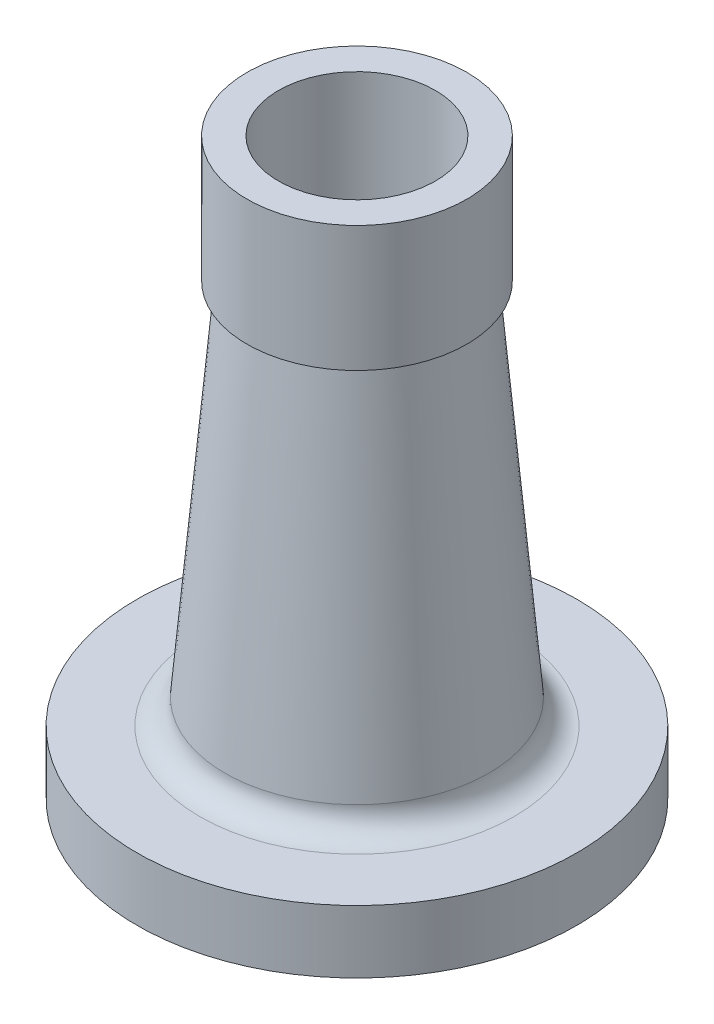
ISO-10303-21;
HEADER;
FILE_DESCRIPTION(('STEP AP214'),'2;1');
FILE_NAME('part.step','',(''),(''),'','','');
FILE_SCHEMA(('AUTOMOTIVE_DESIGN { 1 0 10303 214 1 1 1 1 }'));
ENDSEC;
DATA;
#1=APPLICATION_CONTEXT('core data for automotive mechanical design processes');
#2=APPLICATION_PROTOCOL_DEFINITION('international standard','automotive_design',2000,#1);
#3=PRODUCT_CONTEXT('',#1,'mechanical');
#4=PRODUCT('Part','Part','',(#3));
#5=PRODUCT_RELATED_PRODUCT_CATEGORY('part','',(#4));
#6=PRODUCT_DEFINITION_FORMATION('','',#4);
#7=PRODUCT_DEFINITION_CONTEXT('part definition',#1,'design');
#8=PRODUCT_DEFINITION('design','',#6,#7);
#9=PRODUCT_DEFINITION_SHAPE('','',#8);
#10=(LENGTH_UNIT() NAMED_UNIT(*) SI_UNIT(.MILLI.,.METRE.));
#11=(NAMED_UNIT(*) PLANE_ANGLE_UNIT() SI_UNIT($,.RADIAN.));
#12=(NAMED_UNIT(*) SI_UNIT($,.STERADIAN.) SOLID_ANGLE_UNIT());
#13=UNCERTAINTY_MEASURE_WITH_UNIT(LENGTH_MEASURE(1.E-05),#10,'distance_accuracy_value','');
#14=(GEOMETRIC_REPRESENTATION_CONTEXT(3) GLOBAL_UNCERTAINTY_ASSIGNED_CONTEXT((#13)) GLOBAL_UNIT_ASSIGNED_CONTEXT((#10,
#11,#12)) REPRESENTATION_CONTEXT('',''));
#15=CARTESIAN_POINT('',(0.,0.,0.));
#16=DIRECTION('',(0.,0.,1.));
#17=DIRECTION('',(1.,0.,0.));
#18=AXIS2_PLACEMENT_3D('',#15,#16,#17);
#19=CARTESIAN_POINT('',(0.,-90.2788606175711,0.));
#20=DIRECTION('',(0.,-1.,0.));
#21=DIRECTION('',(0.,0.,-1.));
#22=AXIS2_PLACEMENT_3D('',#19,#20,#21);
#23=CYLINDRICAL_SURFACE('',#22,25.);
#24=CARTESIAN_POINT('',(0.,17.3420060444589,0.));
#25=DIRECTION('',(0.,-1.,0.));
#26=DIRECTION('',(0.,0.,-1.));
#27=AXIS2_PLACEMENT_3D('',#24,#25,#26);
#28=CIRCLE('',#27,25.);
#29=CARTESIAN_POINT('',(0.,17.3420060444589,-25.));
#30=VERTEX_POINT('',#29);
#31=EDGE_CURVE('E41',#30,#30,#28,.T.);
#32=ORIENTED_EDGE('',*,*,#31,.T.);
#33=EDGE_LOOP('',(#32));
#34=FACE_BOUND('',#33,.T.);
#35=CARTESIAN_POINT('',(0.,92.5,0.));
#36=DIRECTION('',(0.,-1.,0.));
#37=DIRECTION('',(0.,0.,-1.));
#38=AXIS2_PLACEMENT_3D('',#35,#36,#37);
#39=CIRCLE('',#38,25.);
#40=CARTESIAN_POINT('',(0.,92.5,-25.));
#41=VERTEX_POINT('',#40);
#42=EDGE_CURVE('E77',#41,#41,#39,.T.);
#43=ORIENTED_EDGE('',*,*,#42,.F.);
#44=EDGE_LOOP('',(#43));
#45=FACE_BOUND('',#44,.T.);
#46=ADVANCED_FACE('F30',(#34,#45),#23,.F.);
#47=CARTESIAN_POINT('',(0.,17.3420060444589,0.));
#48=DIRECTION('',(0.,-1.,0.));
#49=DIRECTION('',(0.,0.,-1.));
#50=AXIS2_PLACEMENT_3D('',#47,#48,#49);
#51=CONICAL_SURFACE('',#50,25.,0.0874448423892873);
#52=CARTESIAN_POINT('',(0.,-28.998781924089,0.));
#53=DIRECTION('',(0.,-1.,0.));
#54=DIRECTION('',(0.,0.,-1.));
#55=AXIS2_PLACEMENT_3D('',#52,#53,#54);
#56=CIRCLE('',#55,29.0626232683506);
#57=CARTESIAN_POINT('',(0.,-28.998781924089,-29.0626232683506));
#58=VERTEX_POINT('',#57);
#59=EDGE_CURVE('E45',#58,#58,#56,.T.);
#60=ORIENTED_EDGE('',*,*,#59,.T.);
#61=EDGE_LOOP('',(#60));
#62=FACE_BOUND('',#61,.T.);
#63=ORIENTED_EDGE('',*,*,#31,.F.);
#64=EDGE_LOOP('',(#63));
#65=FACE_BOUND('',#64,.T.);
#66=ADVANCED_FACE('F85',(#62,#65),#51,.F.);
#67=CARTESIAN_POINT('',(0.,-28.998781924089,0.));
#68=DIRECTION('',(0.,-1.,0.));
#69=DIRECTION('',(0.,0.,-1.));
#70=AXIS2_PLACEMENT_3D('',#67,#68,#69);
#71=CONICAL_SURFACE('',#70,29.0626232683506,0.101526332920951);
#72=CARTESIAN_POINT('',(0.,-87.2788606175711,0.));
#73=DIRECTION('',(0.,-1.,0.));
#74=DIRECTION('',(0.,0.,-1.));
#75=AXIS2_PLACEMENT_3D('',#72,#73,#74);
#76=CIRCLE('',#75,35.);
#77=CARTESIAN_POINT('',(0.,-87.2788606175711,-35.));
#78=VERTEX_POINT('',#77);
#79=EDGE_CURVE('E50',#78,#78,#76,.T.);
#80=ORIENTED_EDGE('',*,*,#79,.T.);
#81=EDGE_LOOP('',(#80));
#82=FACE_BOUND('',#81,.T.);
#83=ORIENTED_EDGE('',*,*,#59,.F.);
#84=EDGE_LOOP('',(#83));
#85=FACE_BOUND('',#84,.T.);
#86=ADVANCED_FACE('F90',(#82,#85),#71,.F.);
#87=CARTESIAN_POINT('',(35.,-87.2788606175711,0.));
#88=DIRECTION('',(0.,-1.,0.));
#89=DIRECTION('',(0.,0.,-1.));
#90=AXIS2_PLACEMENT_3D('',#87,#88,#89);
#91=PLANE('',#90);
#92=CARTESIAN_POINT('',(0.,-87.2788606175711,0.));
#93=DIRECTION('',(0.,-1.,0.));
#94=DIRECTION('',(0.,0.,-1.));
#95=AXIS2_PLACEMENT_3D('',#92,#93,#94);
#96=CIRCLE('',#95,48.5);
#97=CARTESIAN_POINT('',(0.,-87.2788606175711,-48.5));
#98=VERTEX_POINT('',#97);
#99=EDGE_CURVE('E37',#98,#98,#96,.T.);
#100=ORIENTED_EDGE('',*,*,#99,.T.);
#101=EDGE_LOOP('',(#100));
#102=FACE_BOUND('',#101,.T.);
#103=ORIENTED_EDGE('',*,*,#79,.F.);
#104=EDGE_LOOP('',(#103));
#105=FACE_BOUND('',#104,.T.);
#106=ADVANCED_FACE('F96',(#102,#105),#91,.T.);
#107=CARTESIAN_POINT('',(0.,-90.2788606175711,0.));
#108=DIRECTION('',(0.,-1.,0.));
#109=DIRECTION('',(0.,0.,-1.));
#110=AXIS2_PLACEMENT_3D('',#107,#108,#109);
#111=CYLINDRICAL_SURFACE('',#110,50.);
#112=CARTESIAN_POINT('',(0.,-88.7788606175711,0.));
#113=DIRECTION('',(0.,-1.,0.));
#114=DIRECTION('',(0.,0.,-1.));
#115=AXIS2_PLACEMENT_3D('',#112,#113,#114);
#116=CIRCLE('',#115,50.);
#117=CARTESIAN_POINT('',(0.,-88.7788606175711,-50.));
#118=VERTEX_POINT('',#117);
#119=EDGE_CURVE('E10',#118,#118,#116,.F.);
#120=ORIENTED_EDGE('',*,*,#119,.T.);
#121=EDGE_LOOP('',(#120));
#122=FACE_BOUND('',#121,.T.);
#123=CARTESIAN_POINT('',(0.,-90.2788606175711,0.));
#124=DIRECTION('',(0.,-1.,0.));
#125=DIRECTION('',(0.,0.,-1.));
#126=AXIS2_PLACEMENT_3D('',#123,#124,#125);
#127=CIRCLE('',#126,50.);
#128=CARTESIAN_POINT('',(0.,-90.2788606175711,-50.));
#129=VERTEX_POINT('',#128);
#130=EDGE_CURVE('E53',#129,#129,#127,.T.);
#131=ORIENTED_EDGE('',*,*,#130,.T.);
#132=EDGE_LOOP('',(#131));
#133=FACE_BOUND('',#132,.T.);
#134=ADVANCED_FACE('F100',(#122,#133),#111,.F.);
#135=CARTESIAN_POINT('',(50.,-90.2788606175711,0.));
#136=DIRECTION('',(0.,-1.,0.));
#137=DIRECTION('',(0.,0.,-1.));
#138=AXIS2_PLACEMENT_3D('',#135,#136,#137);
#139=PLANE('',#138);
#140=CARTESIAN_POINT('',(0.,-90.2788606175711,0.));
#141=DIRECTION('',(0.,-1.,0.));
#142=DIRECTION('',(0.,0.,-1.));
#143=AXIS2_PLACEMENT_3D('',#140,#141,#142);
#144=CIRCLE('',#143,70.);
#145=CARTESIAN_POINT('',(0.,-90.2788606175711,-70.));
#146=VERTEX_POINT('',#145);
#147=EDGE_CURVE('E56',#146,#146,#144,.T.);
#148=ORIENTED_EDGE('',*,*,#147,.T.);
#149=EDGE_LOOP('',(#148));
#150=FACE_BOUND('',#149,.T.);
#151=ORIENTED_EDGE('',*,*,#130,.F.);
#152=EDGE_LOOP('',(#151));
#153=FACE_BOUND('',#152,.T.);
#154=ADVANCED_FACE('F103',(#150,#153),#139,.T.);
#155=CARTESIAN_POINT('',(0.,-90.2788606175711,0.));
#156=DIRECTION('',(0.,-1.,0.));
#157=DIRECTION('',(0.,0.,-1.));
#158=AXIS2_PLACEMENT_3D('',#155,#156,#157);
#159=CYLINDRICAL_SURFACE('',#158,70.);
#160=CARTESIAN_POINT('',(0.,-70.2788606175711,0.));
#161=DIRECTION('',(0.,-1.,0.));
#162=DIRECTION('',(0.,0.,-1.));
#163=AXIS2_PLACEMENT_3D('',#160,#161,#162);
#164=CIRCLE('',#163,70.);
#165=CARTESIAN_POINT('',(0.,-70.2788606175711,-70.));
#166=VERTEX_POINT('',#165);
#167=EDGE_CURVE('E59',#166,#166,#164,.T.);
#168=ORIENTED_EDGE('',*,*,#167,.T.);
#169=EDGE_LOOP('',(#168));
#170=FACE_BOUND('',#169,.T.);
#171=ORIENTED_EDGE('',*,*,#147,.F.);
#172=EDGE_LOOP('',(#171));
#173=FACE_BOUND('',#172,.T.);
#174=ADVANCED_FACE('F106',(#170,#173),#159,.T.);
#175=CARTESIAN_POINT('',(70.,-70.2788606175711,0.));
#176=DIRECTION('',(0.,1.,0.));
#177=DIRECTION('',(0.,0.,1.));
#178=AXIS2_PLACEMENT_3D('',#175,#176,#177);
#179=PLANE('',#178);
#180=CARTESIAN_POINT('',(0.,-70.2788606175711,0.));
#181=DIRECTION('',(0.,-1.,0.));
#182=DIRECTION('',(0.,0.,-1.));
#183=AXIS2_PLACEMENT_3D('',#180,#181,#182);
#184=CIRCLE('',#183,50.);
#185=CARTESIAN_POINT('',(0.,-70.2788606175711,-50.));
#186=VERTEX_POINT('',#185);
#187=EDGE_CURVE('E62',#186,#186,#184,.T.);
#188=ORIENTED_EDGE('',*,*,#187,.T.);
#189=EDGE_LOOP('',(#188));
#190=FACE_BOUND('',#189,.T.);
#191=ORIENTED_EDGE('',*,*,#167,.F.);
#192=EDGE_LOOP('',(#191));
#193=FACE_BOUND('',#192,.T.);
#194=ADVANCED_FACE('F110',(#190,#193),#179,.T.);
#195=CARTESIAN_POINT('',(0.,-62.2788606175711,0.));
#196=DIRECTION('',(0.,-1.,0.));
#197=DIRECTION('',(0.,0.,-1.));
#198=AXIS2_PLACEMENT_3D('',#195,#196,#197);
#199=TOROIDAL_SURFACE('',#198,50.,8.);
#200=CARTESIAN_POINT('',(0.,-62.2788606175711,0.));
#201=DIRECTION('',(0.,-1.,0.));
#202=DIRECTION('',(0.,0.,-1.));
#203=AXIS2_PLACEMENT_3D('',#200,#201,#202);
#204=CIRCLE('',#203,42.);
#205=CARTESIAN_POINT('',(0.,-62.2788606175711,-42.));
#206=VERTEX_POINT('',#205);
#207=EDGE_CURVE('E65',#206,#206,#204,.T.);
#208=ORIENTED_EDGE('',*,*,#207,.T.);
#209=EDGE_LOOP('',(#208));
#210=FACE_BOUND('',#209,.T.);
#211=ORIENTED_EDGE('',*,*,#187,.F.);
#212=EDGE_LOOP('',(#211));
#213=FACE_BOUND('',#212,.T.);
#214=ADVANCED_FACE('F114',(#210,#213),#199,.F.);
#215=CARTESIAN_POINT('',(0.,-62.2788606175711,0.));
#216=DIRECTION('',(0.,-1.,0.));
#217=DIRECTION('',(0.,0.,-1.));
#218=AXIS2_PLACEMENT_3D('',#215,#216,#217);
#219=CONICAL_SURFACE('',#218,42.,0.0869046142754972);
#220=CARTESIAN_POINT('',(0.,52.5,0.));
#221=DIRECTION('',(0.,-1.,0.));
#222=DIRECTION('',(0.,0.,-1.));
#223=AXIS2_PLACEMENT_3D('',#220,#221,#222);
#224=CIRCLE('',#223,32.);
#225=CARTESIAN_POINT('',(0.,52.5,-32.));
#226=VERTEX_POINT('',#225);
#227=EDGE_CURVE('E68',#226,#226,#224,.T.);
#228=ORIENTED_EDGE('',*,*,#227,.T.);
#229=EDGE_LOOP('',(#228));
#230=FACE_BOUND('',#229,.T.);
#231=ORIENTED_EDGE('',*,*,#207,.F.);
#232=EDGE_LOOP('',(#231));
#233=FACE_BOUND('',#232,.T.);
#234=ADVANCED_FACE('F118',(#230,#233),#219,.T.);
#235=CARTESIAN_POINT('',(35.,52.5,0.));
#236=DIRECTION('',(0.,-1.,0.));
#237=DIRECTION('',(0.,0.,-1.));
#238=AXIS2_PLACEMENT_3D('',#235,#236,#237);
#239=PLANE('',#238);
#240=CARTESIAN_POINT('',(0.,52.5,0.));
#241=DIRECTION('',(0.,-1.,0.));
#242=DIRECTION('',(0.,0.,-1.));
#243=AXIS2_PLACEMENT_3D('',#240,#241,#242);
#244=CIRCLE('',#243,35.);
#245=CARTESIAN_POINT('',(0.,52.5,-35.));
#246=VERTEX_POINT('',#245);
#247=EDGE_CURVE('E71',#246,#246,#244,.T.);
#248=ORIENTED_EDGE('',*,*,#247,.T.);
#249=EDGE_LOOP('',(#248));
#250=FACE_BOUND('',#249,.T.);
#251=ORIENTED_EDGE('',*,*,#227,.F.);
#252=EDGE_LOOP('',(#251));
#253=FACE_BOUND('',#252,.T.);
#254=ADVANCED_FACE('F122',(#250,#253),#239,.T.);
#255=CARTESIAN_POINT('',(0.,-90.2788606175711,0.));
#256=DIRECTION('',(0.,-1.,0.));
#257=DIRECTION('',(0.,0.,-1.));
#258=AXIS2_PLACEMENT_3D('',#255,#256,#257);
#259=CYLINDRICAL_SURFACE('',#258,35.);
#260=CARTESIAN_POINT('',(0.,92.5,0.));
#261=DIRECTION('',(0.,-1.,0.));
#262=DIRECTION('',(0.,0.,-1.));
#263=AXIS2_PLACEMENT_3D('',#260,#261,#262);
#264=CIRCLE('',#263,35.);
#265=CARTESIAN_POINT('',(0.,92.5,-35.));
#266=VERTEX_POINT('',#265);
#267=EDGE_CURVE('E74',#266,#266,#264,.T.);
#268=ORIENTED_EDGE('',*,*,#267,.T.);
#269=EDGE_LOOP('',(#268));
#270=FACE_BOUND('',#269,.T.);
#271=ORIENTED_EDGE('',*,*,#247,.F.);
#272=EDGE_LOOP('',(#271));
#273=FACE_BOUND('',#272,.T.);
#274=ADVANCED_FACE('F126',(#270,#273),#259,.T.);
#275=CARTESIAN_POINT('',(25.,92.5,0.));
#276=DIRECTION('',(0.,1.,0.));
#277=DIRECTION('',(0.,0.,1.));
#278=AXIS2_PLACEMENT_3D('',#275,#276,#277);
#279=PLANE('',#278);
#280=ORIENTED_EDGE('',*,*,#42,.T.);
#281=EDGE_LOOP('',(#280));
#282=FACE_BOUND('',#281,.T.);
#283=ORIENTED_EDGE('',*,*,#267,.F.);
#284=EDGE_LOOP('',(#283));
#285=FACE_BOUND('',#284,.T.);
#286=ADVANCED_FACE('F81',(#282,#285),#279,.T.);
#287=CARTESIAN_POINT('',(0.,-88.7788606175711,0.));
#288=DIRECTION('',(0.,-1.,0.));
#289=DIRECTION('',(0.,0.,-1.));
#290=AXIS2_PLACEMENT_3D('',#287,#288,#289);
#291=TOROIDAL_SURFACE('',#290,48.5,1.5);
#292=ORIENTED_EDGE('',*,*,#119,.F.);
#293=EDGE_LOOP('',(#292));
#294=FACE_BOUND('',#293,.T.);
#295=ORIENTED_EDGE('',*,*,#99,.F.);
#296=EDGE_LOOP('',(#295));
#297=FACE_BOUND('',#296,.T.);
#298=ADVANCED_FACE('F32',(#294,#297),#291,.F.);
#299=CLOSED_SHELL('',(#46,#66,#86,#106,#134,#154,#174,#194,#214,#234,#254,#274,#286,#298));
#300=MANIFOLD_SOLID_BREP('B2',#299);
#301=ADVANCED_BREP_SHAPE_REPRESENTATION('',(#18,#300),#14);
#302=SHAPE_DEFINITION_REPRESENTATION(#9,#301);
ENDSEC;
END-ISO-10303-21;
